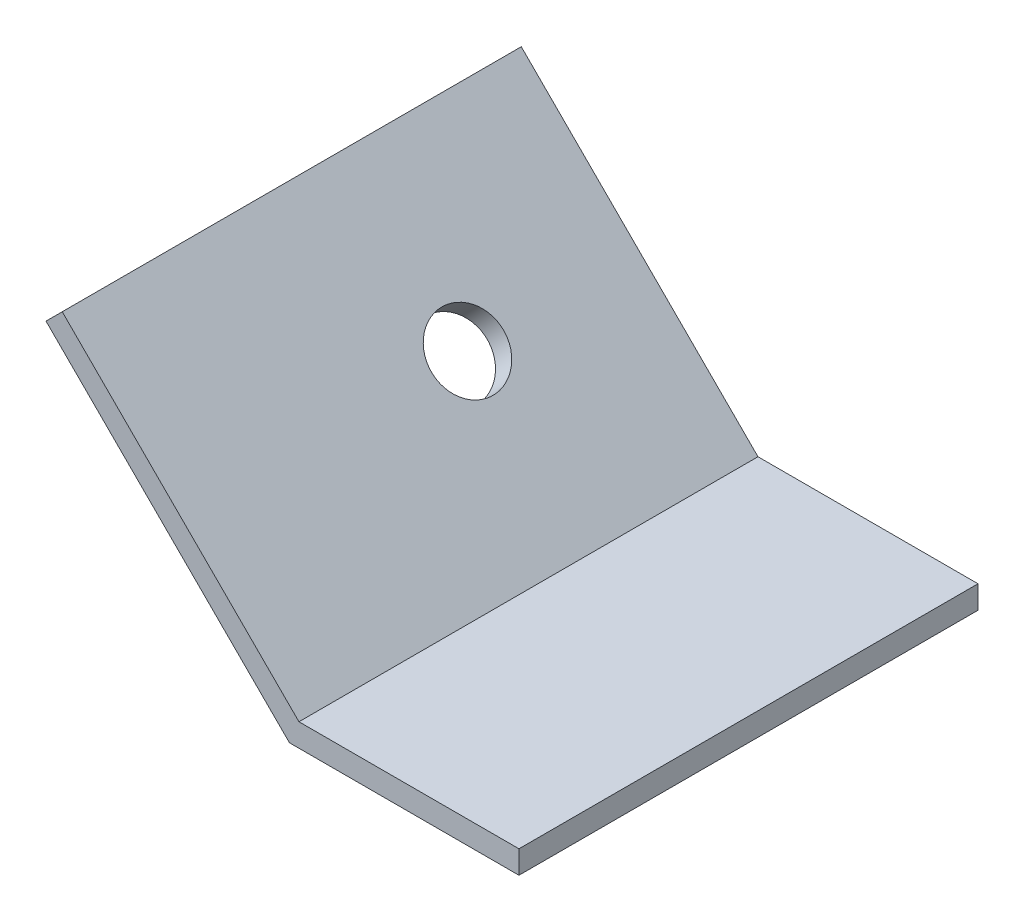
ISO-10303-21;
HEADER;
FILE_DESCRIPTION(('STEP AP214'),'2;1');
FILE_NAME('part.step','',(''),(''),'','','');
FILE_SCHEMA(('AUTOMOTIVE_DESIGN { 1 0 10303 214 1 1 1 1 }'));
ENDSEC;
DATA;
#1=APPLICATION_CONTEXT('core data for automotive mechanical design processes');
#2=APPLICATION_PROTOCOL_DEFINITION('international standard','automotive_design',2000,#1);
#3=PRODUCT_CONTEXT('',#1,'mechanical');
#4=PRODUCT('Part','Part','',(#3));
#5=PRODUCT_RELATED_PRODUCT_CATEGORY('part','',(#4));
#6=PRODUCT_DEFINITION_FORMATION('','',#4);
#7=PRODUCT_DEFINITION_CONTEXT('part definition',#1,'design');
#8=PRODUCT_DEFINITION('design','',#6,#7);
#9=PRODUCT_DEFINITION_SHAPE('','',#8);
#10=(LENGTH_UNIT() NAMED_UNIT(*) SI_UNIT(.MILLI.,.METRE.));
#11=(NAMED_UNIT(*) PLANE_ANGLE_UNIT() SI_UNIT($,.RADIAN.));
#12=(NAMED_UNIT(*) SI_UNIT($,.STERADIAN.) SOLID_ANGLE_UNIT());
#13=UNCERTAINTY_MEASURE_WITH_UNIT(LENGTH_MEASURE(1.E-05),#10,'distance_accuracy_value','');
#14=(GEOMETRIC_REPRESENTATION_CONTEXT(3) GLOBAL_UNCERTAINTY_ASSIGNED_CONTEXT((#13)) GLOBAL_UNIT_ASSIGNED_CONTEXT((#10,
#11,#12)) REPRESENTATION_CONTEXT('',''));
#15=CARTESIAN_POINT('',(0.,0.,0.));
#16=DIRECTION('',(0.,0.,1.));
#17=DIRECTION('',(1.,0.,0.));
#18=AXIS2_PLACEMENT_3D('',#15,#16,#17);
#19=CARTESIAN_POINT('',(0.,0.,50.8));
#20=DIRECTION('',(0.,1.,0.));
#21=DIRECTION('',(0.,0.,1.));
#22=AXIS2_PLACEMENT_3D('',#19,#20,#21);
#23=PLANE('',#22);
#24=DIRECTION('',(1.,0.,0.));
#25=VECTOR('',#24,1.);
#26=CARTESIAN_POINT('',(0.,0.,0.));
#27=LINE('',#26,#25);
#28=CARTESIAN_POINT('',(0.,0.,0.));
#29=VERTEX_POINT('',#28);
#30=CARTESIAN_POINT('',(25.4,0.,0.));
#31=VERTEX_POINT('',#30);
#32=EDGE_CURVE('E113',#29,#31,#27,.T.);
#33=ORIENTED_EDGE('',*,*,#32,.T.);
#34=DIRECTION('',(0.,0.,-1.));
#35=VECTOR('',#34,1.);
#36=CARTESIAN_POINT('',(25.4,0.,50.8));
#37=LINE('',#36,#35);
#38=CARTESIAN_POINT('',(25.4,0.,50.8));
#39=VERTEX_POINT('',#38);
#40=EDGE_CURVE('E11',#39,#31,#37,.T.);
#41=ORIENTED_EDGE('',*,*,#40,.F.);
#42=DIRECTION('',(1.,0.,0.));
#43=VECTOR('',#42,1.);
#44=CARTESIAN_POINT('',(0.,0.,50.8));
#45=LINE('',#44,#43);
#46=CARTESIAN_POINT('',(0.,0.,50.8));
#47=VERTEX_POINT('',#46);
#48=EDGE_CURVE('E78',#47,#39,#45,.T.);
#49=ORIENTED_EDGE('',*,*,#48,.F.);
#50=DIRECTION('',(0.,0.,-1.));
#51=VECTOR('',#50,1.);
#52=CARTESIAN_POINT('',(0.,0.,50.8));
#53=LINE('',#52,#51);
#54=EDGE_CURVE('E109',#47,#29,#53,.T.);
#55=ORIENTED_EDGE('',*,*,#54,.T.);
#56=EDGE_LOOP('',(#33,#41,#49,#55));
#57=FACE_BOUND('',#56,.T.);
#58=ADVANCED_FACE('F32',(#57),#23,.F.);
#59=CARTESIAN_POINT('',(25.4,2.54,50.8));
#60=DIRECTION('',(1.,0.,0.));
#61=DIRECTION('',(0.,0.,-1.));
#62=AXIS2_PLACEMENT_3D('',#59,#60,#61);
#63=PLANE('',#62);
#64=DIRECTION('',(0.,-1.,0.));
#65=VECTOR('',#64,1.);
#66=CARTESIAN_POINT('',(25.4,2.54,0.));
#67=LINE('',#66,#65);
#68=CARTESIAN_POINT('',(25.4,2.54,0.));
#69=VERTEX_POINT('',#68);
#70=EDGE_CURVE('E116',#69,#31,#67,.T.);
#71=ORIENTED_EDGE('',*,*,#70,.F.);
#72=DIRECTION('',(0.,0.,-1.));
#73=VECTOR('',#72,1.);
#74=CARTESIAN_POINT('',(25.4,2.54,50.8));
#75=LINE('',#74,#73);
#76=CARTESIAN_POINT('',(25.4,2.54,50.8));
#77=VERTEX_POINT('',#76);
#78=EDGE_CURVE('E40',#77,#69,#75,.T.);
#79=ORIENTED_EDGE('',*,*,#78,.F.);
#80=DIRECTION('',(0.,-1.,0.));
#81=VECTOR('',#80,1.);
#82=CARTESIAN_POINT('',(25.4,2.54,50.8));
#83=LINE('',#82,#81);
#84=EDGE_CURVE('E174',#77,#39,#83,.T.);
#85=ORIENTED_EDGE('',*,*,#84,.T.);
#86=ORIENTED_EDGE('',*,*,#40,.T.);
#87=EDGE_LOOP('',(#71,#79,#85,#86));
#88=FACE_BOUND('',#87,.T.);
#89=ADVANCED_FACE('F135',(#88),#63,.T.);
#90=CARTESIAN_POINT('',(0.,2.54,50.8));
#91=DIRECTION('',(0.,1.,0.));
#92=DIRECTION('',(0.,0.,1.));
#93=AXIS2_PLACEMENT_3D('',#90,#91,#92);
#94=PLANE('',#93);
#95=DIRECTION('',(1.,0.,0.));
#96=VECTOR('',#95,1.);
#97=CARTESIAN_POINT('',(0.,2.54,0.));
#98=LINE('',#97,#96);
#99=CARTESIAN_POINT('',(1.05210244842766,2.54,0.));
#100=VERTEX_POINT('',#99);
#101=EDGE_CURVE('E120',#100,#69,#98,.T.);
#102=ORIENTED_EDGE('',*,*,#101,.F.);
#103=DIRECTION('',(0.,0.,-1.));
#104=VECTOR('',#103,1.);
#105=CARTESIAN_POINT('',(1.05210244842766,2.54,50.8));
#106=LINE('',#105,#104);
#107=CARTESIAN_POINT('',(1.05210244842766,2.54,50.8));
#108=VERTEX_POINT('',#107);
#109=EDGE_CURVE('E99',#108,#100,#106,.T.);
#110=ORIENTED_EDGE('',*,*,#109,.F.);
#111=DIRECTION('',(1.,0.,0.));
#112=VECTOR('',#111,1.);
#113=CARTESIAN_POINT('',(0.,2.54,50.8));
#114=LINE('',#113,#112);
#115=EDGE_CURVE('E105',#108,#77,#114,.T.);
#116=ORIENTED_EDGE('',*,*,#115,.T.);
#117=ORIENTED_EDGE('',*,*,#78,.T.);
#118=EDGE_LOOP('',(#102,#110,#116,#117));
#119=FACE_BOUND('',#118,.T.);
#120=ADVANCED_FACE('F132',(#119),#94,.T.);
#121=CARTESIAN_POINT('',(-25.1447171389936,28.7368195874213,50.8));
#122=DIRECTION('',(0.707106781186549,0.707106781186546,0.));
#123=DIRECTION('',(-0.707106781186546,0.707106781186549,0.));
#124=AXIS2_PLACEMENT_3D('',#121,#122,#123);
#125=PLANE('',#124);
#126=CARTESIAN_POINT('',(-12.046307345283,15.6384097937107,19.05));
#127=DIRECTION('',(0.707106781186548,0.707106781186547,0.));
#128=DIRECTION('',(-0.707106781186547,0.707106781186548,0.));
#129=AXIS2_PLACEMENT_3D('',#126,#127,#128);
#130=CIRCLE('',#129,4.);
#131=CARTESIAN_POINT('',(-14.8747344700291,18.4668369184569,19.05));
#132=VERTEX_POINT('',#131);
#133=EDGE_CURVE('E167',#132,#132,#130,.T.);
#134=ORIENTED_EDGE('',*,*,#133,.F.);
#135=EDGE_LOOP('',(#134));
#136=FACE_BOUND('',#135,.T.);
#137=DIRECTION('',(0.707106781186546,-0.707106781186549,0.));
#138=VECTOR('',#137,1.);
#139=CARTESIAN_POINT('',(-25.1447171389936,28.7368195874213,0.));
#140=LINE('',#139,#138);
#141=CARTESIAN_POINT('',(-25.1447171389936,28.7368195874213,0.));
#142=VERTEX_POINT('',#141);
#143=EDGE_CURVE('E94',#142,#100,#140,.T.);
#144=ORIENTED_EDGE('',*,*,#143,.F.);
#145=DIRECTION('',(0.,0.,-1.));
#146=VECTOR('',#145,1.);
#147=CARTESIAN_POINT('',(-25.1447171389936,28.7368195874213,50.8));
#148=LINE('',#147,#146);
#149=CARTESIAN_POINT('',(-25.1447171389936,28.7368195874213,50.8));
#150=VERTEX_POINT('',#149);
#151=EDGE_CURVE('E89',#150,#142,#148,.T.);
#152=ORIENTED_EDGE('',*,*,#151,.F.);
#153=DIRECTION('',(0.707106781186546,-0.707106781186549,0.));
#154=VECTOR('',#153,1.);
#155=CARTESIAN_POINT('',(-25.1447171389936,28.7368195874213,50.8));
#156=LINE('',#155,#154);
#157=EDGE_CURVE('E92',#150,#108,#156,.T.);
#158=ORIENTED_EDGE('',*,*,#157,.T.);
#159=ORIENTED_EDGE('',*,*,#109,.T.);
#160=EDGE_LOOP('',(#144,#152,#158,#159));
#161=FACE_BOUND('',#160,.T.);
#162=ADVANCED_FACE('F91',(#136,#161),#125,.T.);
#163=CARTESIAN_POINT('',(-26.9407683632074,26.9407683632075,50.8));
#164=DIRECTION('',(-0.707106781186546,0.707106781186549,0.));
#165=DIRECTION('',(-0.707106781186549,-0.707106781186546,0.));
#166=AXIS2_PLACEMENT_3D('',#163,#164,#165);
#167=PLANE('',#166);
#168=DIRECTION('',(0.707106781186549,0.707106781186546,0.));
#169=VECTOR('',#168,1.);
#170=CARTESIAN_POINT('',(-26.9407683632074,26.9407683632075,0.));
#171=LINE('',#170,#169);
#172=CARTESIAN_POINT('',(-26.9407683632074,26.9407683632075,0.));
#173=VERTEX_POINT('',#172);
#174=EDGE_CURVE('E124',#173,#142,#171,.T.);
#175=ORIENTED_EDGE('',*,*,#174,.F.);
#176=DIRECTION('',(0.,0.,-1.));
#177=VECTOR('',#176,1.);
#178=CARTESIAN_POINT('',(-26.9407683632074,26.9407683632075,50.8));
#179=LINE('',#178,#177);
#180=CARTESIAN_POINT('',(-26.9407683632074,26.9407683632075,50.8));
#181=VERTEX_POINT('',#180);
#182=EDGE_CURVE('E69',#181,#173,#179,.T.);
#183=ORIENTED_EDGE('',*,*,#182,.F.);
#184=DIRECTION('',(0.707106781186549,0.707106781186546,0.));
#185=VECTOR('',#184,1.);
#186=CARTESIAN_POINT('',(-26.9407683632074,26.9407683632075,50.8));
#187=LINE('',#186,#185);
#188=EDGE_CURVE('E103',#181,#150,#187,.T.);
#189=ORIENTED_EDGE('',*,*,#188,.T.);
#190=ORIENTED_EDGE('',*,*,#151,.T.);
#191=EDGE_LOOP('',(#175,#183,#189,#190));
#192=FACE_BOUND('',#191,.T.);
#193=ADVANCED_FACE('F107',(#192),#167,.T.);
#194=CARTESIAN_POINT('',(-26.9407683632074,26.9407683632075,50.8));
#195=DIRECTION('',(0.707106781186549,0.707106781186546,0.));
#196=DIRECTION('',(-0.707106781186546,0.707106781186549,0.));
#197=AXIS2_PLACEMENT_3D('',#194,#195,#196);
#198=PLANE('',#197);
#199=CARTESIAN_POINT('',(-13.8423585694968,13.8423585694968,19.05));
#200=DIRECTION('',(0.707106781186549,0.707106781186546,0.));
#201=DIRECTION('',(-0.707106781186546,0.707106781186549,0.));
#202=AXIS2_PLACEMENT_3D('',#199,#200,#201);
#203=CIRCLE('',#202,4.);
#204=CARTESIAN_POINT('',(-16.670785694243,16.670785694243,19.05));
#205=VERTEX_POINT('',#204);
#206=EDGE_CURVE('E117',#205,#205,#203,.F.);
#207=ORIENTED_EDGE('',*,*,#206,.F.);
#208=EDGE_LOOP('',(#207));
#209=FACE_BOUND('',#208,.T.);
#210=DIRECTION('',(0.707106781186546,-0.707106781186549,0.));
#211=VECTOR('',#210,1.);
#212=CARTESIAN_POINT('',(-26.9407683632074,26.9407683632075,0.));
#213=LINE('',#212,#211);
#214=EDGE_CURVE('E72',#173,#29,#213,.T.);
#215=ORIENTED_EDGE('',*,*,#214,.T.);
#216=ORIENTED_EDGE('',*,*,#54,.F.);
#217=DIRECTION('',(0.707106781186546,-0.707106781186549,0.));
#218=VECTOR('',#217,1.);
#219=CARTESIAN_POINT('',(-26.9407683632074,26.9407683632075,50.8));
#220=LINE('',#219,#218);
#221=EDGE_CURVE('E48',#181,#47,#220,.T.);
#222=ORIENTED_EDGE('',*,*,#221,.F.);
#223=ORIENTED_EDGE('',*,*,#182,.T.);
#224=EDGE_LOOP('',(#215,#216,#222,#223));
#225=FACE_BOUND('',#224,.T.);
#226=ADVANCED_FACE('F140',(#209,#225),#198,.F.);
#227=CARTESIAN_POINT('',(0.,0.,50.8));
#228=DIRECTION('',(0.,0.,-1.));
#229=DIRECTION('',(-1.,0.,0.));
#230=AXIS2_PLACEMENT_3D('',#227,#228,#229);
#231=PLANE('',#230);
#232=ORIENTED_EDGE('',*,*,#48,.T.);
#233=ORIENTED_EDGE('',*,*,#84,.F.);
#234=ORIENTED_EDGE('',*,*,#115,.F.);
#235=ORIENTED_EDGE('',*,*,#157,.F.);
#236=ORIENTED_EDGE('',*,*,#188,.F.);
#237=ORIENTED_EDGE('',*,*,#221,.T.);
#238=EDGE_LOOP('',(#232,#233,#234,#235,#236,#237));
#239=FACE_BOUND('',#238,.T.);
#240=ADVANCED_FACE('F102',(#239),#231,.F.);
#241=CARTESIAN_POINT('',(0.,0.,0.));
#242=DIRECTION('',(0.,0.,-1.));
#243=DIRECTION('',(-1.,0.,0.));
#244=AXIS2_PLACEMENT_3D('',#241,#242,#243);
#245=PLANE('',#244);
#246=ORIENTED_EDGE('',*,*,#32,.F.);
#247=ORIENTED_EDGE('',*,*,#214,.F.);
#248=ORIENTED_EDGE('',*,*,#174,.T.);
#249=ORIENTED_EDGE('',*,*,#143,.T.);
#250=ORIENTED_EDGE('',*,*,#101,.T.);
#251=ORIENTED_EDGE('',*,*,#70,.T.);
#252=EDGE_LOOP('',(#246,#247,#248,#249,#250,#251));
#253=FACE_BOUND('',#252,.T.);
#254=ADVANCED_FACE('F138',(#253),#245,.T.);
#255=CARTESIAN_POINT('',(-27.3137427511005,0.370974387893122,19.05));
#256=DIRECTION('',(0.707106781186548,0.707106781186547,0.));
#257=DIRECTION('',(-0.707106781186547,0.707106781186548,0.));
#258=AXIS2_PLACEMENT_3D('',#255,#256,#257);
#259=CYLINDRICAL_SURFACE('',#258,4.);
#260=ORIENTED_EDGE('',*,*,#133,.T.);
#261=EDGE_LOOP('',(#260));
#262=FACE_BOUND('',#261,.T.);
#263=ORIENTED_EDGE('',*,*,#206,.T.);
#264=EDGE_LOOP('',(#263));
#265=FACE_BOUND('',#264,.T.);
#266=ADVANCED_FACE('F176',(#262,#265),#259,.F.);
#267=CLOSED_SHELL('',(#58,#89,#120,#162,#193,#226,#240,#254,#266));
#268=MANIFOLD_SOLID_BREP('B2',#267);
#269=ADVANCED_BREP_SHAPE_REPRESENTATION('',(#18,#268),#14);
#270=SHAPE_DEFINITION_REPRESENTATION(#9,#269);
ENDSEC;
END-ISO-10303-21;
